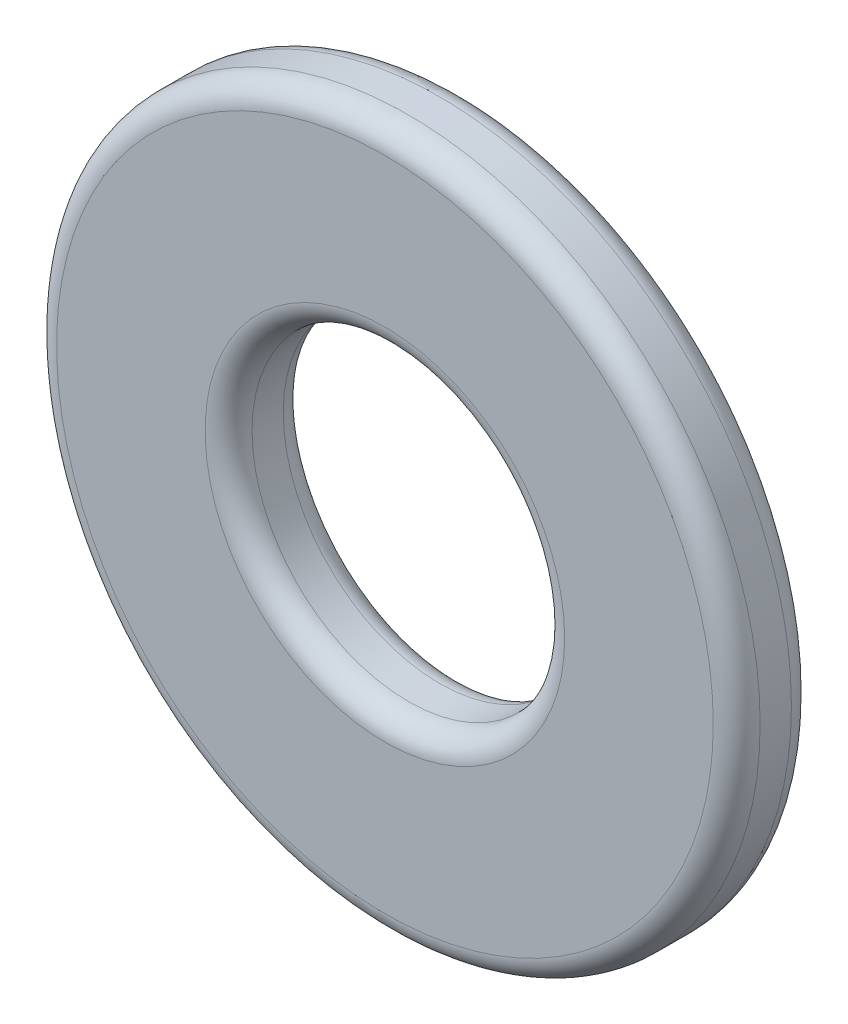
ISO-10303-21;
HEADER;
FILE_DESCRIPTION(('STEP AP214'),'2;1');
FILE_NAME('part.step','',(''),(''),'','','');
FILE_SCHEMA(('AUTOMOTIVE_DESIGN { 1 0 10303 214 1 1 1 1 }'));
ENDSEC;
DATA;
#1=APPLICATION_CONTEXT('core data for automotive mechanical design processes');
#2=APPLICATION_PROTOCOL_DEFINITION('international standard','automotive_design',2000,#1);
#3=PRODUCT_CONTEXT('',#1,'mechanical');
#4=PRODUCT('Part','Part','',(#3));
#5=PRODUCT_RELATED_PRODUCT_CATEGORY('part','',(#4));
#6=PRODUCT_DEFINITION_FORMATION('','',#4);
#7=PRODUCT_DEFINITION_CONTEXT('part definition',#1,'design');
#8=PRODUCT_DEFINITION('design','',#6,#7);
#9=PRODUCT_DEFINITION_SHAPE('','',#8);
#10=(LENGTH_UNIT() NAMED_UNIT(*) SI_UNIT(.MILLI.,.METRE.));
#11=(NAMED_UNIT(*) PLANE_ANGLE_UNIT() SI_UNIT($,.RADIAN.));
#12=(NAMED_UNIT(*) SI_UNIT($,.STERADIAN.) SOLID_ANGLE_UNIT());
#13=UNCERTAINTY_MEASURE_WITH_UNIT(LENGTH_MEASURE(1.E-05),#10,'distance_accuracy_value','');
#14=(GEOMETRIC_REPRESENTATION_CONTEXT(3) GLOBAL_UNCERTAINTY_ASSIGNED_CONTEXT((#13)) GLOBAL_UNIT_ASSIGNED_CONTEXT((#10,
#11,#12)) REPRESENTATION_CONTEXT('',''));
#15=CARTESIAN_POINT('',(0.,0.,0.));
#16=DIRECTION('',(0.,0.,1.));
#17=DIRECTION('',(1.,0.,0.));
#18=AXIS2_PLACEMENT_3D('',#15,#16,#17);
#19=CARTESIAN_POINT('',(0.,0.,0.25));
#20=DIRECTION('',(0.,0.,1.));
#21=DIRECTION('',(1.,0.,0.));
#22=AXIS2_PLACEMENT_3D('',#19,#20,#21);
#23=PLANE('',#22);
#24=CARTESIAN_POINT('',(0.,0.,0.25));
#25=DIRECTION('',(0.,0.,1.));
#26=DIRECTION('',(1.,0.,0.));
#27=AXIS2_PLACEMENT_3D('',#24,#25,#26);
#28=CIRCLE('',#27,1.15);
#29=CARTESIAN_POINT('',(1.15,0.,0.25));
#30=VERTEX_POINT('',#29);
#31=EDGE_CURVE('E43',#30,#30,#28,.F.);
#32=ORIENTED_EDGE('',*,*,#31,.T.);
#33=EDGE_LOOP('',(#32));
#34=FACE_BOUND('',#33,.T.);
#35=CARTESIAN_POINT('',(0.,0.,0.25));
#36=DIRECTION('',(0.,0.,1.));
#37=DIRECTION('',(1.,0.,0.));
#38=AXIS2_PLACEMENT_3D('',#35,#36,#37);
#39=CIRCLE('',#38,2.1);
#40=CARTESIAN_POINT('',(2.1,0.,0.25));
#41=VERTEX_POINT('',#40);
#42=EDGE_CURVE('E47',#41,#41,#39,.T.);
#43=ORIENTED_EDGE('',*,*,#42,.T.);
#44=EDGE_LOOP('',(#43));
#45=FACE_BOUND('',#44,.T.);
#46=ADVANCED_FACE('F32',(#34,#45),#23,.T.);
#47=CARTESIAN_POINT('',(0.,0.,-0.25));
#48=DIRECTION('',(0.,0.,1.));
#49=DIRECTION('',(1.,0.,0.));
#50=AXIS2_PLACEMENT_3D('',#47,#48,#49);
#51=PLANE('',#50);
#52=CARTESIAN_POINT('',(0.,0.,-0.25));
#53=DIRECTION('',(0.,0.,1.));
#54=DIRECTION('',(1.,0.,0.));
#55=AXIS2_PLACEMENT_3D('',#52,#53,#54);
#56=CIRCLE('',#55,1.15);
#57=CARTESIAN_POINT('',(1.15,0.,-0.25));
#58=VERTEX_POINT('',#57);
#59=EDGE_CURVE('E58',#58,#58,#56,.T.);
#60=ORIENTED_EDGE('',*,*,#59,.T.);
#61=EDGE_LOOP('',(#60));
#62=FACE_BOUND('',#61,.T.);
#63=CARTESIAN_POINT('',(0.,0.,-0.25));
#64=DIRECTION('',(0.,0.,1.));
#65=DIRECTION('',(1.,0.,0.));
#66=AXIS2_PLACEMENT_3D('',#63,#64,#65);
#67=CIRCLE('',#66,2.1);
#68=CARTESIAN_POINT('',(2.1,0.,-0.25));
#69=VERTEX_POINT('',#68);
#70=EDGE_CURVE('E61',#69,#69,#67,.F.);
#71=ORIENTED_EDGE('',*,*,#70,.T.);
#72=EDGE_LOOP('',(#71));
#73=FACE_BOUND('',#72,.T.);
#74=ADVANCED_FACE('F65',(#62,#73),#51,.F.);
#75=CARTESIAN_POINT('',(0.,0.,0.25));
#76=DIRECTION('',(0.,0.,-1.));
#77=DIRECTION('',(-1.,0.,0.));
#78=AXIS2_PLACEMENT_3D('',#75,#76,#77);
#79=CYLINDRICAL_SURFACE('',#78,2.25);
#80=CARTESIAN_POINT('',(0.,0.,-0.1));
#81=DIRECTION('',(0.,0.,1.));
#82=DIRECTION('',(1.,0.,0.));
#83=AXIS2_PLACEMENT_3D('',#80,#81,#82);
#84=CIRCLE('',#83,2.25);
#85=CARTESIAN_POINT('',(2.25,0.,-0.1));
#86=VERTEX_POINT('',#85);
#87=EDGE_CURVE('E10',#86,#86,#84,.T.);
#88=ORIENTED_EDGE('',*,*,#87,.T.);
#89=EDGE_LOOP('',(#88));
#90=FACE_BOUND('',#89,.T.);
#91=CARTESIAN_POINT('',(0.,0.,0.1));
#92=DIRECTION('',(0.,0.,1.));
#93=DIRECTION('',(1.,0.,0.));
#94=AXIS2_PLACEMENT_3D('',#91,#92,#93);
#95=CIRCLE('',#94,2.25);
#96=CARTESIAN_POINT('',(2.25,0.,0.1));
#97=VERTEX_POINT('',#96);
#98=EDGE_CURVE('E39',#97,#97,#95,.F.);
#99=ORIENTED_EDGE('',*,*,#98,.T.);
#100=EDGE_LOOP('',(#99));
#101=FACE_BOUND('',#100,.T.);
#102=ADVANCED_FACE('F85',(#90,#101),#79,.T.);
#103=CARTESIAN_POINT('',(0.,0.,0.25));
#104=DIRECTION('',(0.,0.,-1.));
#105=DIRECTION('',(-1.,0.,0.));
#106=AXIS2_PLACEMENT_3D('',#103,#104,#105);
#107=CYLINDRICAL_SURFACE('',#106,1.);
#108=CARTESIAN_POINT('',(0.,0.,-0.1));
#109=DIRECTION('',(0.,0.,1.));
#110=DIRECTION('',(1.,0.,0.));
#111=AXIS2_PLACEMENT_3D('',#108,#109,#110);
#112=CIRCLE('',#111,1.);
#113=CARTESIAN_POINT('',(1.,0.,-0.1));
#114=VERTEX_POINT('',#113);
#115=EDGE_CURVE('E52',#114,#114,#112,.F.);
#116=ORIENTED_EDGE('',*,*,#115,.T.);
#117=EDGE_LOOP('',(#116));
#118=FACE_BOUND('',#117,.T.);
#119=CARTESIAN_POINT('',(0.,0.,0.1));
#120=DIRECTION('',(0.,0.,1.));
#121=DIRECTION('',(1.,0.,0.));
#122=AXIS2_PLACEMENT_3D('',#119,#120,#121);
#123=CIRCLE('',#122,1.);
#124=CARTESIAN_POINT('',(1.,0.,0.1));
#125=VERTEX_POINT('',#124);
#126=EDGE_CURVE('E55',#125,#125,#123,.T.);
#127=ORIENTED_EDGE('',*,*,#126,.T.);
#128=EDGE_LOOP('',(#127));
#129=FACE_BOUND('',#128,.T.);
#130=ADVANCED_FACE('F90',(#118,#129),#107,.F.);
#131=CARTESIAN_POINT('',(0.,0.,-0.1));
#132=DIRECTION('',(0.,0.,1.));
#133=DIRECTION('',(1.,0.,0.));
#134=AXIS2_PLACEMENT_3D('',#131,#132,#133);
#135=TOROIDAL_SURFACE('',#134,1.15,0.15);
#136=ORIENTED_EDGE('',*,*,#115,.F.);
#137=EDGE_LOOP('',(#136));
#138=FACE_BOUND('',#137,.T.);
#139=ORIENTED_EDGE('',*,*,#59,.F.);
#140=EDGE_LOOP('',(#139));
#141=FACE_BOUND('',#140,.T.);
#142=ADVANCED_FACE('F76',(#138,#141),#135,.T.);
#143=CARTESIAN_POINT('',(0.,0.,0.1));
#144=DIRECTION('',(0.,0.,1.));
#145=DIRECTION('',(1.,0.,0.));
#146=AXIS2_PLACEMENT_3D('',#143,#144,#145);
#147=TOROIDAL_SURFACE('',#146,1.15,0.15);
#148=ORIENTED_EDGE('',*,*,#31,.F.);
#149=EDGE_LOOP('',(#148));
#150=FACE_BOUND('',#149,.T.);
#151=ORIENTED_EDGE('',*,*,#126,.F.);
#152=EDGE_LOOP('',(#151));
#153=FACE_BOUND('',#152,.T.);
#154=ADVANCED_FACE('F70',(#150,#153),#147,.T.);
#155=CARTESIAN_POINT('',(0.,0.,-0.1));
#156=DIRECTION('',(0.,0.,1.));
#157=DIRECTION('',(1.,0.,0.));
#158=AXIS2_PLACEMENT_3D('',#155,#156,#157);
#159=TOROIDAL_SURFACE('',#158,2.1,0.15);
#160=ORIENTED_EDGE('',*,*,#70,.F.);
#161=EDGE_LOOP('',(#160));
#162=FACE_BOUND('',#161,.T.);
#163=ORIENTED_EDGE('',*,*,#87,.F.);
#164=EDGE_LOOP('',(#163));
#165=FACE_BOUND('',#164,.T.);
#166=ADVANCED_FACE('F67',(#162,#165),#159,.T.);
#167=CARTESIAN_POINT('',(0.,0.,0.1));
#168=DIRECTION('',(0.,0.,1.));
#169=DIRECTION('',(1.,0.,0.));
#170=AXIS2_PLACEMENT_3D('',#167,#168,#169);
#171=TOROIDAL_SURFACE('',#170,2.1,0.15);
#172=ORIENTED_EDGE('',*,*,#98,.F.);
#173=EDGE_LOOP('',(#172));
#174=FACE_BOUND('',#173,.T.);
#175=ORIENTED_EDGE('',*,*,#42,.F.);
#176=EDGE_LOOP('',(#175));
#177=FACE_BOUND('',#176,.T.);
#178=ADVANCED_FACE('F34',(#174,#177),#171,.T.);
#179=CLOSED_SHELL('',(#46,#74,#102,#130,#142,#154,#166,#178));
#180=MANIFOLD_SOLID_BREP('B2',#179);
#181=ADVANCED_BREP_SHAPE_REPRESENTATION('',(#18,#180),#14);
#182=SHAPE_DEFINITION_REPRESENTATION(#9,#181);
ENDSEC;
END-ISO-10303-21;
